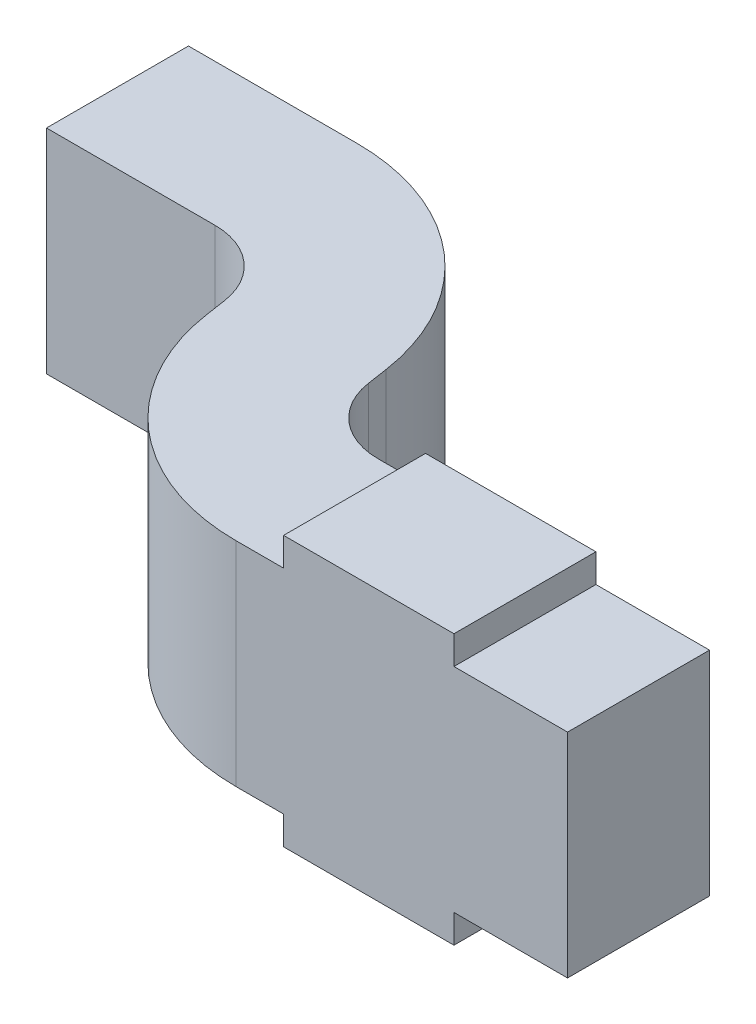
ISO-10303-21;
HEADER;
FILE_DESCRIPTION(('STEP AP214'),'2;1');
FILE_NAME('part.step','',(''),(''),'','','');
FILE_SCHEMA(('AUTOMOTIVE_DESIGN { 1 0 10303 214 1 1 1 1 }'));
ENDSEC;
DATA;
#1=APPLICATION_CONTEXT('core data for automotive mechanical design processes');
#2=APPLICATION_PROTOCOL_DEFINITION('international standard','automotive_design',2000,#1);
#3=PRODUCT_CONTEXT('',#1,'mechanical');
#4=PRODUCT('Part','Part','',(#3));
#5=PRODUCT_RELATED_PRODUCT_CATEGORY('part','',(#4));
#6=PRODUCT_DEFINITION_FORMATION('','',#4);
#7=PRODUCT_DEFINITION_CONTEXT('part definition',#1,'design');
#8=PRODUCT_DEFINITION('design','',#6,#7);
#9=PRODUCT_DEFINITION_SHAPE('','',#8);
#10=(LENGTH_UNIT() NAMED_UNIT(*) SI_UNIT(.MILLI.,.METRE.));
#11=(NAMED_UNIT(*) PLANE_ANGLE_UNIT() SI_UNIT($,.RADIAN.));
#12=(NAMED_UNIT(*) SI_UNIT($,.STERADIAN.) SOLID_ANGLE_UNIT());
#13=UNCERTAINTY_MEASURE_WITH_UNIT(LENGTH_MEASURE(1.E-05),#10,'distance_accuracy_value','');
#14=(GEOMETRIC_REPRESENTATION_CONTEXT(3) GLOBAL_UNCERTAINTY_ASSIGNED_CONTEXT((#13)) GLOBAL_UNIT_ASSIGNED_CONTEXT((#10,
#11,#12)) REPRESENTATION_CONTEXT('',''));
#15=CARTESIAN_POINT('',(0.,0.,0.));
#16=DIRECTION('',(0.,0.,1.));
#17=DIRECTION('',(1.,0.,0.));
#18=AXIS2_PLACEMENT_3D('',#15,#16,#17);
#19=CARTESIAN_POINT('',(-3.23,0.47500000000005,0.925));
#20=DIRECTION('',(0.,1.,0.));
#21=DIRECTION('',(1.,0.,0.));
#22=AXIS2_PLACEMENT_3D('',#19,#20,#21);
#23=PLANE('',#22);
#24=DIRECTION('',(1.,0.,0.));
#25=VECTOR('',#24,1.);
#26=CARTESIAN_POINT('',(-3.23,0.47500000000005,1.425));
#27=LINE('',#26,#25);
#28=CARTESIAN_POINT('',(-3.23,0.47500000000005,1.425));
#29=VERTEX_POINT('',#28);
#30=CARTESIAN_POINT('',(-2.63000000000008,0.47500000000005,1.425));
#31=VERTEX_POINT('',#30);
#32=EDGE_CURVE('E313',#29,#31,#27,.T.);
#33=ORIENTED_EDGE('',*,*,#32,.T.);
#34=DIRECTION('',(0.,0.,1.));
#35=VECTOR('',#34,1.);
#36=CARTESIAN_POINT('',(-2.63000000000008,0.47500000000005,0.925));
#37=LINE('',#36,#35);
#38=CARTESIAN_POINT('',(-2.63000000000008,0.47500000000005,0.925));
#39=VERTEX_POINT('',#38);
#40=EDGE_CURVE('E243',#39,#31,#37,.T.);
#41=ORIENTED_EDGE('',*,*,#40,.F.);
#42=DIRECTION('',(1.,0.,0.));
#43=VECTOR('',#42,1.);
#44=CARTESIAN_POINT('',(-3.23,0.47500000000005,0.925));
#45=LINE('',#44,#43);
#46=CARTESIAN_POINT('',(-3.23,0.47500000000005,0.925));
#47=VERTEX_POINT('',#46);
#48=EDGE_CURVE('E355',#47,#39,#45,.T.);
#49=ORIENTED_EDGE('',*,*,#48,.F.);
#50=DIRECTION('',(0.,0.,1.));
#51=VECTOR('',#50,1.);
#52=CARTESIAN_POINT('',(-3.23,0.47500000000005,0.925));
#53=LINE('',#52,#51);
#54=EDGE_CURVE('E419',#47,#29,#53,.T.);
#55=ORIENTED_EDGE('',*,*,#54,.T.);
#56=EDGE_LOOP('',(#33,#41,#49,#55));
#57=FACE_BOUND('',#56,.T.);
#58=ADVANCED_FACE('F17',(#57),#23,.T.);
#59=CARTESIAN_POINT('',(-3.23,-0.47499999999994,0.925));
#60=DIRECTION('',(-1.,0.,0.));
#61=DIRECTION('',(0.,0.,1.));
#62=AXIS2_PLACEMENT_3D('',#59,#60,#61);
#63=PLANE('',#62);
#64=DIRECTION('',(0.,0.,-1.));
#65=VECTOR('',#64,1.);
#66=CARTESIAN_POINT('',(-3.23,-0.375,0.85410254983609));
#67=LINE('',#66,#65);
#68=CARTESIAN_POINT('',(-3.23,-0.375,1.425));
#69=VERTEX_POINT('',#68);
#70=CARTESIAN_POINT('',(-3.23,-0.375,0.924999999999963));
#71=VERTEX_POINT('',#70);
#72=EDGE_CURVE('E253',#69,#71,#67,.T.);
#73=ORIENTED_EDGE('',*,*,#72,.T.);
#74=DIRECTION('',(0.,1.,0.));
#75=VECTOR('',#74,1.);
#76=CARTESIAN_POINT('',(-3.23,-0.47499999999994,0.925));
#77=LINE('',#76,#75);
#78=CARTESIAN_POINT('',(-3.23,-0.47499999999994,0.925));
#79=VERTEX_POINT('',#78);
#80=EDGE_CURVE('E399',#79,#71,#77,.T.);
#81=ORIENTED_EDGE('',*,*,#80,.F.);
#82=DIRECTION('',(0.,0.,1.));
#83=VECTOR('',#82,1.);
#84=CARTESIAN_POINT('',(-3.23,-0.47499999999994,0.925));
#85=LINE('',#84,#83);
#86=CARTESIAN_POINT('',(-3.23,-0.47499999999994,1.425));
#87=VERTEX_POINT('',#86);
#88=EDGE_CURVE('E11',#79,#87,#85,.T.);
#89=ORIENTED_EDGE('',*,*,#88,.T.);
#90=DIRECTION('',(0.,1.,0.));
#91=VECTOR('',#90,1.);
#92=CARTESIAN_POINT('',(-3.23,-0.47499999999994,1.425));
#93=LINE('',#92,#91);
#94=EDGE_CURVE('E310',#87,#69,#93,.T.);
#95=ORIENTED_EDGE('',*,*,#94,.T.);
#96=EDGE_LOOP('',(#73,#81,#89,#95));
#97=FACE_BOUND('',#96,.T.);
#98=ADVANCED_FACE('F471',(#97),#63,.T.);
#99=CARTESIAN_POINT('',(-2.63000000000008,-0.47499999999994,0.925));
#100=DIRECTION('',(0.,-1.,0.));
#101=DIRECTION('',(-1.,0.,0.));
#102=AXIS2_PLACEMENT_3D('',#99,#100,#101);
#103=PLANE('',#102);
#104=DIRECTION('',(-1.,0.,0.));
#105=VECTOR('',#104,1.);
#106=CARTESIAN_POINT('',(-2.63000000000008,-0.47499999999994,1.425));
#107=LINE('',#106,#105);
#108=CARTESIAN_POINT('',(-2.63000000000008,-0.47499999999994,1.425));
#109=VERTEX_POINT('',#108);
#110=EDGE_CURVE('E239',#109,#87,#107,.T.);
#111=ORIENTED_EDGE('',*,*,#110,.T.);
#112=ORIENTED_EDGE('',*,*,#88,.F.);
#113=DIRECTION('',(-1.,0.,0.));
#114=VECTOR('',#113,1.);
#115=CARTESIAN_POINT('',(-2.63000000000008,-0.47499999999994,0.925));
#116=LINE('',#115,#114);
#117=CARTESIAN_POINT('',(-2.63000000000008,-0.47499999999994,0.925));
#118=VERTEX_POINT('',#117);
#119=EDGE_CURVE('E294',#118,#79,#116,.T.);
#120=ORIENTED_EDGE('',*,*,#119,.F.);
#121=DIRECTION('',(0.,0.,1.));
#122=VECTOR('',#121,1.);
#123=CARTESIAN_POINT('',(-2.63000000000008,-0.47499999999994,0.925));
#124=LINE('',#123,#122);
#125=EDGE_CURVE('E25',#118,#109,#124,.T.);
#126=ORIENTED_EDGE('',*,*,#125,.T.);
#127=EDGE_LOOP('',(#111,#112,#120,#126));
#128=FACE_BOUND('',#127,.T.);
#129=ADVANCED_FACE('F472',(#128),#103,.T.);
#130=CARTESIAN_POINT('',(-2.63000000000008,0.47500000000005,0.925));
#131=DIRECTION('',(1.,0.,0.));
#132=DIRECTION('',(0.,-1.,0.));
#133=AXIS2_PLACEMENT_3D('',#130,#131,#132);
#134=PLANE('',#133);
#135=DIRECTION('',(0.,0.,1.));
#136=VECTOR('',#135,1.);
#137=CARTESIAN_POINT('',(-2.63000000000008,-0.375,0.85410254983609));
#138=LINE('',#137,#136);
#139=CARTESIAN_POINT('',(-2.63000000000008,-0.375,0.925));
#140=VERTEX_POINT('',#139);
#141=CARTESIAN_POINT('',(-2.63000000000008,-0.375,1.425));
#142=VERTEX_POINT('',#141);
#143=EDGE_CURVE('E249',#140,#142,#138,.T.);
#144=ORIENTED_EDGE('',*,*,#143,.T.);
#145=DIRECTION('',(0.,-1.,0.));
#146=VECTOR('',#145,1.);
#147=CARTESIAN_POINT('',(-2.63000000000008,0.47500000000005,1.425));
#148=LINE('',#147,#146);
#149=EDGE_CURVE('E232',#142,#109,#148,.T.);
#150=ORIENTED_EDGE('',*,*,#149,.T.);
#151=ORIENTED_EDGE('',*,*,#125,.F.);
#152=DIRECTION('',(0.,-1.,0.));
#153=VECTOR('',#152,1.);
#154=CARTESIAN_POINT('',(-2.63000000000008,0.47500000000005,0.925));
#155=LINE('',#154,#153);
#156=EDGE_CURVE('E257',#140,#118,#155,.T.);
#157=ORIENTED_EDGE('',*,*,#156,.F.);
#158=EDGE_LOOP('',(#144,#150,#151,#157));
#159=FACE_BOUND('',#158,.T.);
#160=ADVANCED_FACE('F255',(#159),#134,.T.);
#161=CARTESIAN_POINT('',(-2.63000000000008,0.47500000000005,0.925));
#162=DIRECTION('',(1.,0.,0.));
#163=DIRECTION('',(0.,-1.,0.));
#164=AXIS2_PLACEMENT_3D('',#161,#162,#163);
#165=PLANE('',#164);
#166=DIRECTION('',(0.,0.,-1.));
#167=VECTOR('',#166,1.);
#168=CARTESIAN_POINT('',(-2.63000000000008,0.375,0.85410254983609));
#169=LINE('',#168,#167);
#170=CARTESIAN_POINT('',(-2.63000000000008,0.375,1.425));
#171=VERTEX_POINT('',#170);
#172=CARTESIAN_POINT('',(-2.63000000000008,0.375,0.925));
#173=VERTEX_POINT('',#172);
#174=EDGE_CURVE('E339',#171,#173,#169,.T.);
#175=ORIENTED_EDGE('',*,*,#174,.T.);
#176=DIRECTION('',(0.,-1.,0.));
#177=VECTOR('',#176,1.);
#178=CARTESIAN_POINT('',(-2.63000000000008,0.47500000000005,0.925));
#179=LINE('',#178,#177);
#180=EDGE_CURVE('E351',#39,#173,#179,.T.);
#181=ORIENTED_EDGE('',*,*,#180,.F.);
#182=ORIENTED_EDGE('',*,*,#40,.T.);
#183=DIRECTION('',(0.,-1.,0.));
#184=VECTOR('',#183,1.);
#185=CARTESIAN_POINT('',(-2.63000000000008,0.47500000000005,1.425));
#186=LINE('',#185,#184);
#187=EDGE_CURVE('E354',#31,#171,#186,.T.);
#188=ORIENTED_EDGE('',*,*,#187,.T.);
#189=EDGE_LOOP('',(#175,#181,#182,#188));
#190=FACE_BOUND('',#189,.T.);
#191=ADVANCED_FACE('F438',(#190),#165,.T.);
#192=CARTESIAN_POINT('',(-2.93000000000004,0.,1.425));
#193=DIRECTION('',(0.,0.,1.));
#194=DIRECTION('',(1.,0.,0.));
#195=AXIS2_PLACEMENT_3D('',#192,#193,#194);
#196=PLANE('',#195);
#197=ORIENTED_EDGE('',*,*,#187,.F.);
#198=ORIENTED_EDGE('',*,*,#32,.F.);
#199=DIRECTION('',(0.,1.,0.));
#200=VECTOR('',#199,1.);
#201=CARTESIAN_POINT('',(-3.23,-0.47499999999994,1.425));
#202=LINE('',#201,#200);
#203=CARTESIAN_POINT('',(-3.23,0.375,1.425));
#204=VERTEX_POINT('',#203);
#205=EDGE_CURVE('E415',#204,#29,#202,.T.);
#206=ORIENTED_EDGE('',*,*,#205,.F.);
#207=DIRECTION('',(-1.,0.,0.));
#208=VECTOR('',#207,1.);
#209=CARTESIAN_POINT('',(-2.23000000000008,0.375,1.425));
#210=LINE('',#209,#208);
#211=CARTESIAN_POINT('',(-3.39710678118641,0.375,1.425));
#212=VERTEX_POINT('',#211);
#213=EDGE_CURVE('E412',#204,#212,#210,.T.);
#214=ORIENTED_EDGE('',*,*,#213,.T.);
#215=DIRECTION('',(0.,1.,0.));
#216=VECTOR('',#215,1.);
#217=CARTESIAN_POINT('',(-3.39710678118641,-0.375,1.425));
#218=LINE('',#217,#216);
#219=CARTESIAN_POINT('',(-3.39710678118641,-0.375,1.425));
#220=VERTEX_POINT('',#219);
#221=EDGE_CURVE('E356',#220,#212,#218,.T.);
#222=ORIENTED_EDGE('',*,*,#221,.F.);
#223=DIRECTION('',(-1.,0.,0.));
#224=VECTOR('',#223,1.);
#225=CARTESIAN_POINT('',(-2.23000000000008,-0.375,1.425));
#226=LINE('',#225,#224);
#227=EDGE_CURVE('E279',#69,#220,#226,.T.);
#228=ORIENTED_EDGE('',*,*,#227,.F.);
#229=ORIENTED_EDGE('',*,*,#94,.F.);
#230=ORIENTED_EDGE('',*,*,#110,.F.);
#231=ORIENTED_EDGE('',*,*,#149,.F.);
#232=DIRECTION('',(-1.,0.,0.));
#233=VECTOR('',#232,1.);
#234=CARTESIAN_POINT('',(-2.23000000000008,-0.375,1.425));
#235=LINE('',#234,#233);
#236=CARTESIAN_POINT('',(-2.23000000000008,-0.375,1.425));
#237=VERTEX_POINT('',#236);
#238=EDGE_CURVE('E236',#237,#142,#235,.T.);
#239=ORIENTED_EDGE('',*,*,#238,.F.);
#240=DIRECTION('',(0.,1.,0.));
#241=VECTOR('',#240,1.);
#242=CARTESIAN_POINT('',(-2.23000000000008,-0.375,1.425));
#243=LINE('',#242,#241);
#244=CARTESIAN_POINT('',(-2.23000000000008,0.375,1.425));
#245=VERTEX_POINT('',#244);
#246=EDGE_CURVE('E287',#237,#245,#243,.T.);
#247=ORIENTED_EDGE('',*,*,#246,.T.);
#248=DIRECTION('',(-1.,0.,0.));
#249=VECTOR('',#248,1.);
#250=CARTESIAN_POINT('',(-2.23000000000008,0.375,1.425));
#251=LINE('',#250,#249);
#252=EDGE_CURVE('E343',#245,#171,#251,.T.);
#253=ORIENTED_EDGE('',*,*,#252,.T.);
#254=EDGE_LOOP('',(#197,#198,#206,#214,#222,#228,#229,#230,#231,#239,#247,#253));
#255=FACE_BOUND('',#254,.T.);
#256=ADVANCED_FACE('F235',(#255),#196,.T.);
#257=CARTESIAN_POINT('',(-2.93000000000004,0.,0.925));
#258=DIRECTION('',(0.,0.,1.));
#259=DIRECTION('',(1.,0.,0.));
#260=AXIS2_PLACEMENT_3D('',#257,#258,#259);
#261=PLANE('',#260);
#262=ORIENTED_EDGE('',*,*,#156,.T.);
#263=ORIENTED_EDGE('',*,*,#119,.T.);
#264=ORIENTED_EDGE('',*,*,#80,.T.);
#265=DIRECTION('',(1.,0.,0.));
#266=VECTOR('',#265,1.);
#267=CARTESIAN_POINT('',(-3.39710678118641,-0.375,0.924999999999955));
#268=LINE('',#267,#266);
#269=CARTESIAN_POINT('',(-3.39710678118641,-0.375,0.924999999999955));
#270=VERTEX_POINT('',#269);
#271=EDGE_CURVE('E335',#270,#71,#268,.T.);
#272=ORIENTED_EDGE('',*,*,#271,.F.);
#273=DIRECTION('',(0.,1.,0.));
#274=VECTOR('',#273,1.);
#275=CARTESIAN_POINT('',(-3.39710678118641,-0.375,0.924999999999955));
#276=LINE('',#275,#274);
#277=CARTESIAN_POINT('',(-3.39710678118641,0.375,0.924999999999955));
#278=VERTEX_POINT('',#277);
#279=EDGE_CURVE('E508',#270,#278,#276,.T.);
#280=ORIENTED_EDGE('',*,*,#279,.T.);
#281=DIRECTION('',(1.,0.,0.));
#282=VECTOR('',#281,1.);
#283=CARTESIAN_POINT('',(-3.39710678118641,0.375,0.924999999999955));
#284=LINE('',#283,#282);
#285=CARTESIAN_POINT('',(-3.23,0.375,0.924999999999963));
#286=VERTEX_POINT('',#285);
#287=EDGE_CURVE('E394',#278,#286,#284,.T.);
#288=ORIENTED_EDGE('',*,*,#287,.T.);
#289=DIRECTION('',(0.,1.,0.));
#290=VECTOR('',#289,1.);
#291=CARTESIAN_POINT('',(-3.23,-0.47499999999994,0.925));
#292=LINE('',#291,#290);
#293=EDGE_CURVE('E295',#286,#47,#292,.T.);
#294=ORIENTED_EDGE('',*,*,#293,.T.);
#295=ORIENTED_EDGE('',*,*,#48,.T.);
#296=ORIENTED_EDGE('',*,*,#180,.T.);
#297=DIRECTION('',(1.,0.,0.));
#298=VECTOR('',#297,1.);
#299=CARTESIAN_POINT('',(-3.39710678118641,0.375,0.924999999999955));
#300=LINE('',#299,#298);
#301=CARTESIAN_POINT('',(-2.23000000000008,0.375,0.925000000000011));
#302=VERTEX_POINT('',#301);
#303=EDGE_CURVE('E327',#173,#302,#300,.T.);
#304=ORIENTED_EDGE('',*,*,#303,.T.);
#305=DIRECTION('',(0.,1.,0.));
#306=VECTOR('',#305,1.);
#307=CARTESIAN_POINT('',(-2.23000000000008,-0.375,0.925000000000011));
#308=LINE('',#307,#306);
#309=CARTESIAN_POINT('',(-2.23000000000008,-0.375,0.925000000000011));
#310=VERTEX_POINT('',#309);
#311=EDGE_CURVE('E361',#310,#302,#308,.T.);
#312=ORIENTED_EDGE('',*,*,#311,.F.);
#313=DIRECTION('',(1.,0.,0.));
#314=VECTOR('',#313,1.);
#315=CARTESIAN_POINT('',(-3.39710678118641,-0.375,0.924999999999955));
#316=LINE('',#315,#314);
#317=EDGE_CURVE('E260',#140,#310,#316,.T.);
#318=ORIENTED_EDGE('',*,*,#317,.F.);
#319=EDGE_LOOP('',(#262,#263,#264,#272,#280,#288,#294,#295,#296,#304,#312,#318));
#320=FACE_BOUND('',#319,.T.);
#321=ADVANCED_FACE('F449',(#320),#261,.F.);
#322=CARTESIAN_POINT('',(-3.23,-0.47499999999994,0.925));
#323=DIRECTION('',(-1.,0.,0.));
#324=DIRECTION('',(0.,0.,1.));
#325=AXIS2_PLACEMENT_3D('',#322,#323,#324);
#326=PLANE('',#325);
#327=DIRECTION('',(0.,0.,1.));
#328=VECTOR('',#327,1.);
#329=CARTESIAN_POINT('',(-3.23,0.375,0.85410254983609));
#330=LINE('',#329,#328);
#331=EDGE_CURVE('E390',#286,#204,#330,.T.);
#332=ORIENTED_EDGE('',*,*,#331,.T.);
#333=ORIENTED_EDGE('',*,*,#205,.T.);
#334=ORIENTED_EDGE('',*,*,#54,.F.);
#335=ORIENTED_EDGE('',*,*,#293,.F.);
#336=EDGE_LOOP('',(#332,#333,#334,#335));
#337=FACE_BOUND('',#336,.T.);
#338=ADVANCED_FACE('F453',(#337),#326,.T.);
#339=CARTESIAN_POINT('',(-3.64791907855811,0.375,0.78320509967218));
#340=DIRECTION('',(0.,-1.,0.));
#341=DIRECTION('',(-1.,0.,0.));
#342=AXIS2_PLACEMENT_3D('',#339,#340,#341);
#343=PLANE('',#342);
#344=ORIENTED_EDGE('',*,*,#331,.F.);
#345=ORIENTED_EDGE('',*,*,#287,.F.);
#346=CARTESIAN_POINT('',(-3.39710678118638,0.375,0.67499999999993));
#347=DIRECTION('',(0.,1.,0.));
#348=DIRECTION('',(-0.65224191465017,0.,0.758010873783141));
#349=AXIS2_PLACEMENT_3D('',#346,#347,#348);
#350=CIRCLE('',#349,0.250000000000025);
#351=CARTESIAN_POINT('',(-3.56016725984894,0.375,0.864502718445734));
#352=VERTEX_POINT('',#351);
#353=EDGE_CURVE('E519',#352,#278,#350,.T.);
#354=ORIENTED_EDGE('',*,*,#353,.F.);
#355=CARTESIAN_POINT('',(-3.39710678118638,0.375,0.67499999999993));
#356=DIRECTION('',(0.,1.,0.));
#357=DIRECTION('',(-0.65224191465017,0.,0.758010873783141));
#358=AXIS2_PLACEMENT_3D('',#355,#356,#357);
#359=CIRCLE('',#358,0.250000000000025);
#360=CARTESIAN_POINT('',(-3.64431001300739,0.375,0.7122902423867));
#361=VERTEX_POINT('',#360);
#362=EDGE_CURVE('E284',#361,#352,#359,.T.);
#363=ORIENTED_EDGE('',*,*,#362,.F.);
#364=DIRECTION('',(0.149160969547199,0.,0.988812927283892));
#365=VECTOR('',#364,1.);
#366=CARTESIAN_POINT('',(-3.65549708572354,0.375,0.638129272839649));
#367=LINE('',#366,#365);
#368=CARTESIAN_POINT('',(-3.65549708572354,0.375,0.638129272839649));
#369=VERTEX_POINT('',#368);
#370=EDGE_CURVE('E384',#369,#361,#367,.T.);
#371=ORIENTED_EDGE('',*,*,#370,.F.);
#372=CARTESIAN_POINT('',(-4.39710678118645,0.375,0.750000000000045));
#373=DIRECTION('',(0.,-1.,0.));
#374=DIRECTION('',(0.652241914650113,0.,-0.75801087378319));
#375=AXIS2_PLACEMENT_3D('',#372,#373,#374);
#376=CIRCLE('',#375,0.749999999999988);
#377=CARTESIAN_POINT('',(-3.90792534519888,0.375,0.181491844662661));
#378=VERTEX_POINT('',#377);
#379=EDGE_CURVE('E479',#378,#369,#376,.T.);
#380=ORIENTED_EDGE('',*,*,#379,.F.);
#381=CARTESIAN_POINT('',(-4.39710678118645,0.375,0.750000000000045));
#382=DIRECTION('',(0.,-1.,0.));
#383=DIRECTION('',(0.652241914650113,0.,-0.75801087378319));
#384=AXIS2_PLACEMENT_3D('',#381,#382,#383);
#385=CIRCLE('',#384,0.749999999999988);
#386=CARTESIAN_POINT('',(-4.39710678118638,0.375,0.));
#387=VERTEX_POINT('',#386);
#388=EDGE_CURVE('E381',#387,#378,#385,.T.);
#389=ORIENTED_EDGE('',*,*,#388,.F.);
#390=DIRECTION('',(1.,0.,0.));
#391=VECTOR('',#390,1.);
#392=CARTESIAN_POINT('',(-4.99,0.375,0.));
#393=LINE('',#392,#391);
#394=CARTESIAN_POINT('',(-4.99,0.375,0.));
#395=VERTEX_POINT('',#394);
#396=EDGE_CURVE('E304',#395,#387,#393,.T.);
#397=ORIENTED_EDGE('',*,*,#396,.F.);
#398=DIRECTION('',(0.,0.,-1.));
#399=VECTOR('',#398,1.);
#400=CARTESIAN_POINT('',(-4.99,0.375,0.499999999999943));
#401=LINE('',#400,#399);
#402=CARTESIAN_POINT('',(-4.99,0.375,0.499999999999943));
#403=VERTEX_POINT('',#402);
#404=EDGE_CURVE('E305',#403,#395,#401,.T.);
#405=ORIENTED_EDGE('',*,*,#404,.F.);
#406=DIRECTION('',(-1.,0.,-6.71122420360616E-13));
#407=VECTOR('',#406,1.);
#408=CARTESIAN_POINT('',(-4.39710678118624,0.375,0.500000000000341));
#409=LINE('',#408,#407);
#410=CARTESIAN_POINT('',(-4.39710678118624,0.375,0.500000000000341));
#411=VERTEX_POINT('',#410);
#412=EDGE_CURVE('E364',#411,#403,#409,.T.);
#413=ORIENTED_EDGE('',*,*,#412,.F.);
#414=CARTESIAN_POINT('',(-4.39710678118642,0.375,0.750000000000349));
#415=DIRECTION('',(0.,1.,0.));
#416=DIRECTION('',(0.652241914650429,0.,-0.758010873782918));
#417=AXIS2_PLACEMENT_3D('',#414,#415,#416);
#418=CIRCLE('',#417,0.250000000000008);
#419=CARTESIAN_POINT('',(-4.2340463025238,0.375,0.560497281554614));
#420=VERTEX_POINT('',#419);
#421=EDGE_CURVE('E270',#420,#411,#418,.T.);
#422=ORIENTED_EDGE('',*,*,#421,.F.);
#423=CARTESIAN_POINT('',(-4.39710678118642,0.375,0.750000000000349));
#424=DIRECTION('',(0.,1.,0.));
#425=DIRECTION('',(0.652241914650429,0.,-0.758010873782918));
#426=AXIS2_PLACEMENT_3D('',#423,#424,#425);
#427=CIRCLE('',#426,0.250000000000008);
#428=CARTESIAN_POINT('',(-4.14990354936543,0.375,0.712709757613595));
#429=VERTEX_POINT('',#428);
#430=EDGE_CURVE('E350',#429,#420,#427,.T.);
#431=ORIENTED_EDGE('',*,*,#430,.F.);
#432=DIRECTION('',(-0.149160969547128,0.,-0.988812927283903));
#433=VECTOR('',#432,1.);
#434=CARTESIAN_POINT('',(-4.13871647664934,0.375,0.786870727160306));
#435=LINE('',#434,#433);
#436=CARTESIAN_POINT('',(-4.13871647664934,0.375,0.786870727160306));
#437=VERTEX_POINT('',#436);
#438=EDGE_CURVE('E395',#437,#429,#435,.T.);
#439=ORIENTED_EDGE('',*,*,#438,.F.);
#440=CARTESIAN_POINT('',(-3.3971067811864,0.375,0.67500000000001));
#441=DIRECTION('',(0.,-1.,0.));
#442=DIRECTION('',(-0.652241914650137,0.,0.758010873783169));
#443=AXIS2_PLACEMENT_3D('',#440,#441,#442);
#444=CIRCLE('',#443,0.75);
#445=CARTESIAN_POINT('',(-3.886288217174,0.375,1.24350815533739));
#446=VERTEX_POINT('',#445);
#447=EDGE_CURVE('E460',#446,#437,#444,.T.);
#448=ORIENTED_EDGE('',*,*,#447,.F.);
#449=CARTESIAN_POINT('',(-3.3971067811864,0.375,0.67500000000001));
#450=DIRECTION('',(0.,-1.,0.));
#451=DIRECTION('',(-0.652241914650137,0.,0.758010873783169));
#452=AXIS2_PLACEMENT_3D('',#449,#450,#451);
#453=CIRCLE('',#452,0.75);
#454=EDGE_CURVE('E360',#212,#446,#453,.T.);
#455=ORIENTED_EDGE('',*,*,#454,.F.);
#456=ORIENTED_EDGE('',*,*,#213,.F.);
#457=EDGE_LOOP('',(#344,#345,#354,#363,#371,#380,#389,#397,#405,#413,#422,#431,#439,#448,#455,#456));
#458=FACE_BOUND('',#457,.T.);
#459=ADVANCED_FACE('F457',(#458),#343,.F.);
#460=CARTESIAN_POINT('',(-4.13871647664934,-0.375,0.786870727160306));
#461=DIRECTION('',(-0.988812927283903,0.,0.149160969547128));
#462=DIRECTION('',(0.,1.,0.));
#463=AXIS2_PLACEMENT_3D('',#460,#461,#462);
#464=PLANE('',#463);
#465=ORIENTED_EDGE('',*,*,#438,.T.);
#466=DIRECTION('',(0.,1.,0.));
#467=VECTOR('',#466,1.);
#468=CARTESIAN_POINT('',(-4.14990354936544,-0.375,0.712709757613595));
#469=LINE('',#468,#467);
#470=CARTESIAN_POINT('',(-4.14990354936544,-0.375,0.712709757613595));
#471=VERTEX_POINT('',#470);
#472=EDGE_CURVE('E331',#471,#429,#469,.T.);
#473=ORIENTED_EDGE('',*,*,#472,.F.);
#474=DIRECTION('',(-0.149160969547128,0.,-0.988812927283903));
#475=VECTOR('',#474,1.);
#476=CARTESIAN_POINT('',(-4.13871647664934,-0.375,0.786870727160306));
#477=LINE('',#476,#475);
#478=CARTESIAN_POINT('',(-4.13871647664934,-0.375,0.786870727160306));
#479=VERTEX_POINT('',#478);
#480=EDGE_CURVE('E291',#479,#471,#477,.T.);
#481=ORIENTED_EDGE('',*,*,#480,.F.);
#482=DIRECTION('',(0.,1.,0.));
#483=VECTOR('',#482,1.);
#484=CARTESIAN_POINT('',(-4.13871647664934,-0.375,0.786870727160306));
#485=LINE('',#484,#483);
#486=EDGE_CURVE('E524',#479,#437,#485,.T.);
#487=ORIENTED_EDGE('',*,*,#486,.T.);
#488=EDGE_LOOP('',(#465,#473,#481,#487));
#489=FACE_BOUND('',#488,.T.);
#490=ADVANCED_FACE('F975',(#489),#464,.T.);
#491=CARTESIAN_POINT('',(-3.3971067811864,-0.375,0.67500000000001));
#492=DIRECTION('',(0.,1.,0.));
#493=DIRECTION('',(-0.652241914650137,0.,0.758010873783169));
#494=AXIS2_PLACEMENT_3D('',#491,#492,#493);
#495=CYLINDRICAL_SURFACE('',#494,0.75);
#496=DIRECTION('',(0.,1.,0.));
#497=VECTOR('',#496,1.);
#498=CARTESIAN_POINT('',(-3.886288217174,-0.375,1.24350815533739));
#499=LINE('',#498,#497);
#500=CARTESIAN_POINT('',(-3.886288217174,-0.375,1.24350815533739));
#501=VERTEX_POINT('',#500);
#502=EDGE_CURVE('E533',#501,#446,#499,.T.);
#503=ORIENTED_EDGE('',*,*,#502,.F.);
#504=CARTESIAN_POINT('',(-3.3971067811864,-0.375,0.67500000000001));
#505=DIRECTION('',(0.,-1.,0.));
#506=DIRECTION('',(-0.652241914650137,0.,0.758010873783169));
#507=AXIS2_PLACEMENT_3D('',#504,#505,#506);
#508=CIRCLE('',#507,0.75);
#509=EDGE_CURVE('E283',#220,#501,#508,.T.);
#510=ORIENTED_EDGE('',*,*,#509,.F.);
#511=ORIENTED_EDGE('',*,*,#221,.T.);
#512=ORIENTED_EDGE('',*,*,#454,.T.);
#513=EDGE_LOOP('',(#503,#510,#511,#512));
#514=FACE_BOUND('',#513,.T.);
#515=ADVANCED_FACE('F465',(#514),#495,.T.);
#516=CARTESIAN_POINT('',(-2.23000000000008,-0.375,0.925000000000011));
#517=DIRECTION('',(1.,0.,0.));
#518=DIRECTION('',(0.,-1.,0.));
#519=AXIS2_PLACEMENT_3D('',#516,#517,#518);
#520=PLANE('',#519);
#521=DIRECTION('',(0.,0.,1.));
#522=VECTOR('',#521,1.);
#523=CARTESIAN_POINT('',(-2.23000000000008,0.375,0.925000000000011));
#524=LINE('',#523,#522);
#525=EDGE_CURVE('E332',#302,#245,#524,.T.);
#526=ORIENTED_EDGE('',*,*,#525,.T.);
#527=ORIENTED_EDGE('',*,*,#246,.F.);
#528=DIRECTION('',(0.,0.,1.));
#529=VECTOR('',#528,1.);
#530=CARTESIAN_POINT('',(-2.23000000000008,-0.375,0.925000000000011));
#531=LINE('',#530,#529);
#532=EDGE_CURVE('E251',#310,#237,#531,.T.);
#533=ORIENTED_EDGE('',*,*,#532,.F.);
#534=ORIENTED_EDGE('',*,*,#311,.T.);
#535=EDGE_LOOP('',(#526,#527,#533,#534));
#536=FACE_BOUND('',#535,.T.);
#537=ADVANCED_FACE('F916',(#536),#520,.T.);
#538=CARTESIAN_POINT('',(-3.39710678118638,-0.375,0.67499999999993));
#539=DIRECTION('',(0.,1.,0.));
#540=DIRECTION('',(-0.65224191465017,0.,0.758010873783141));
#541=AXIS2_PLACEMENT_3D('',#538,#539,#540);
#542=CYLINDRICAL_SURFACE('',#541,0.250000000000025);
#543=DIRECTION('',(0.,1.,0.));
#544=VECTOR('',#543,1.);
#545=CARTESIAN_POINT('',(-3.56016725984894,-0.375,0.864502718445734));
#546=LINE('',#545,#544);
#547=CARTESIAN_POINT('',(-3.56016725984894,-0.375,0.864502718445734));
#548=VERTEX_POINT('',#547);
#549=EDGE_CURVE('E523',#548,#352,#546,.T.);
#550=ORIENTED_EDGE('',*,*,#549,.F.);
#551=CARTESIAN_POINT('',(-3.39710678118638,-0.375,0.67499999999993));
#552=DIRECTION('',(0.,1.,0.));
#553=DIRECTION('',(-0.65224191465017,0.,0.758010873783141));
#554=AXIS2_PLACEMENT_3D('',#551,#552,#553);
#555=CIRCLE('',#554,0.250000000000025);
#556=CARTESIAN_POINT('',(-3.64431001300739,-0.375,0.7122902423867));
#557=VERTEX_POINT('',#556);
#558=EDGE_CURVE('E326',#557,#548,#555,.T.);
#559=ORIENTED_EDGE('',*,*,#558,.F.);
#560=DIRECTION('',(0.,1.,0.));
#561=VECTOR('',#560,1.);
#562=CARTESIAN_POINT('',(-3.64431001300739,-0.375,0.7122902423867));
#563=LINE('',#562,#561);
#564=EDGE_CURVE('E288',#557,#361,#563,.T.);
#565=ORIENTED_EDGE('',*,*,#564,.T.);
#566=ORIENTED_EDGE('',*,*,#362,.T.);
#567=EDGE_LOOP('',(#550,#559,#565,#566));
#568=FACE_BOUND('',#567,.T.);
#569=ADVANCED_FACE('F559',(#568),#542,.F.);
#570=CARTESIAN_POINT('',(-3.65549708572354,-0.375,0.638129272839649));
#571=DIRECTION('',(0.988812927283892,0.,-0.149160969547199));
#572=DIRECTION('',(0.,-1.,0.));
#573=AXIS2_PLACEMENT_3D('',#570,#571,#572);
#574=PLANE('',#573);
#575=ORIENTED_EDGE('',*,*,#370,.T.);
#576=ORIENTED_EDGE('',*,*,#564,.F.);
#577=DIRECTION('',(0.149160969547199,0.,0.988812927283892));
#578=VECTOR('',#577,1.);
#579=CARTESIAN_POINT('',(-3.65549708572354,-0.375,0.638129272839649));
#580=LINE('',#579,#578);
#581=CARTESIAN_POINT('',(-3.65549708572354,-0.375,0.638129272839649));
#582=VERTEX_POINT('',#581);
#583=EDGE_CURVE('E322',#582,#557,#580,.T.);
#584=ORIENTED_EDGE('',*,*,#583,.F.);
#585=DIRECTION('',(0.,1.,0.));
#586=VECTOR('',#585,1.);
#587=CARTESIAN_POINT('',(-3.65549708572354,-0.375,0.638129272839649));
#588=LINE('',#587,#586);
#589=EDGE_CURVE('E481',#582,#369,#588,.T.);
#590=ORIENTED_EDGE('',*,*,#589,.T.);
#591=EDGE_LOOP('',(#575,#576,#584,#590));
#592=FACE_BOUND('',#591,.T.);
#593=ADVANCED_FACE('F563',(#592),#574,.T.);
#594=CARTESIAN_POINT('',(-4.39710678118645,-0.375,0.750000000000045));
#595=DIRECTION('',(0.,1.,0.));
#596=DIRECTION('',(0.652241914650113,0.,-0.75801087378319));
#597=AXIS2_PLACEMENT_3D('',#594,#595,#596);
#598=CYLINDRICAL_SURFACE('',#597,0.749999999999988);
#599=DIRECTION('',(0.,1.,0.));
#600=VECTOR('',#599,1.);
#601=CARTESIAN_POINT('',(-3.90792534519888,-0.375,0.181491844662661));
#602=LINE('',#601,#600);
#603=CARTESIAN_POINT('',(-3.90792534519888,-0.375,0.181491844662661));
#604=VERTEX_POINT('',#603);
#605=EDGE_CURVE('E507',#604,#378,#602,.T.);
#606=ORIENTED_EDGE('',*,*,#605,.F.);
#607=CARTESIAN_POINT('',(-4.39710678118645,-0.375,0.750000000000045));
#608=DIRECTION('',(0.,-1.,0.));
#609=DIRECTION('',(0.652241914650113,0.,-0.75801087378319));
#610=AXIS2_PLACEMENT_3D('',#607,#608,#609);
#611=CIRCLE('',#610,0.749999999999988);
#612=CARTESIAN_POINT('',(-4.39710678118638,-0.375,0.));
#613=VERTEX_POINT('',#612);
#614=EDGE_CURVE('E321',#613,#604,#611,.T.);
#615=ORIENTED_EDGE('',*,*,#614,.F.);
#616=DIRECTION('',(0.,1.,0.));
#617=VECTOR('',#616,1.);
#618=CARTESIAN_POINT('',(-4.39710678118638,-0.375,0.));
#619=LINE('',#618,#617);
#620=EDGE_CURVE('E377',#613,#387,#619,.T.);
#621=ORIENTED_EDGE('',*,*,#620,.T.);
#622=ORIENTED_EDGE('',*,*,#388,.T.);
#623=EDGE_LOOP('',(#606,#615,#621,#622));
#624=FACE_BOUND('',#623,.T.);
#625=ADVANCED_FACE('F886',(#624),#598,.T.);
#626=CARTESIAN_POINT('',(-4.99,-0.375,0.));
#627=DIRECTION('',(0.,0.,-1.));
#628=DIRECTION('',(0.,-1.,0.));
#629=AXIS2_PLACEMENT_3D('',#626,#627,#628);
#630=PLANE('',#629);
#631=ORIENTED_EDGE('',*,*,#396,.T.);
#632=ORIENTED_EDGE('',*,*,#620,.F.);
#633=DIRECTION('',(1.,0.,0.));
#634=VECTOR('',#633,1.);
#635=CARTESIAN_POINT('',(-4.99,-0.375,0.));
#636=LINE('',#635,#634);
#637=CARTESIAN_POINT('',(-4.99,-0.375,0.));
#638=VERTEX_POINT('',#637);
#639=EDGE_CURVE('E317',#638,#613,#636,.T.);
#640=ORIENTED_EDGE('',*,*,#639,.F.);
#641=DIRECTION('',(0.,1.,0.));
#642=VECTOR('',#641,1.);
#643=CARTESIAN_POINT('',(-4.99,-0.375,0.));
#644=LINE('',#643,#642);
#645=EDGE_CURVE('E300',#638,#395,#644,.T.);
#646=ORIENTED_EDGE('',*,*,#645,.T.);
#647=EDGE_LOOP('',(#631,#632,#640,#646));
#648=FACE_BOUND('',#647,.T.);
#649=ADVANCED_FACE('F898',(#648),#630,.T.);
#650=CARTESIAN_POINT('',(-4.99,-0.375,0.499999999999943));
#651=DIRECTION('',(-1.,0.,0.));
#652=DIRECTION('',(0.,0.,1.));
#653=AXIS2_PLACEMENT_3D('',#650,#651,#652);
#654=PLANE('',#653);
#655=ORIENTED_EDGE('',*,*,#404,.T.);
#656=ORIENTED_EDGE('',*,*,#645,.F.);
#657=DIRECTION('',(0.,0.,-1.));
#658=VECTOR('',#657,1.);
#659=CARTESIAN_POINT('',(-4.99,-0.375,0.499999999999943));
#660=LINE('',#659,#658);
#661=CARTESIAN_POINT('',(-4.99,-0.375,0.499999999999943));
#662=VERTEX_POINT('',#661);
#663=EDGE_CURVE('E309',#662,#638,#660,.T.);
#664=ORIENTED_EDGE('',*,*,#663,.F.);
#665=DIRECTION('',(0.,1.,0.));
#666=VECTOR('',#665,1.);
#667=CARTESIAN_POINT('',(-4.99,-0.375,0.499999999999943));
#668=LINE('',#667,#666);
#669=EDGE_CURVE('E368',#662,#403,#668,.T.);
#670=ORIENTED_EDGE('',*,*,#669,.T.);
#671=EDGE_LOOP('',(#655,#656,#664,#670));
#672=FACE_BOUND('',#671,.T.);
#673=ADVANCED_FACE('F902',(#672),#654,.T.);
#674=CARTESIAN_POINT('',(-4.39710678118624,-0.375,0.500000000000341));
#675=DIRECTION('',(-6.71122420360616E-13,0.,1.));
#676=DIRECTION('',(1.,0.,6.71122420360616E-13));
#677=AXIS2_PLACEMENT_3D('',#674,#675,#676);
#678=PLANE('',#677);
#679=ORIENTED_EDGE('',*,*,#412,.T.);
#680=ORIENTED_EDGE('',*,*,#669,.F.);
#681=DIRECTION('',(-1.,0.,-6.71122420360616E-13));
#682=VECTOR('',#681,1.);
#683=CARTESIAN_POINT('',(-4.39710678118624,-0.375,0.500000000000341));
#684=LINE('',#683,#682);
#685=CARTESIAN_POINT('',(-4.39710678118624,-0.375,0.500000000000341));
#686=VERTEX_POINT('',#685);
#687=EDGE_CURVE('E299',#686,#662,#684,.T.);
#688=ORIENTED_EDGE('',*,*,#687,.F.);
#689=DIRECTION('',(0.,1.,0.));
#690=VECTOR('',#689,1.);
#691=CARTESIAN_POINT('',(-4.39710678118624,-0.375,0.500000000000341));
#692=LINE('',#691,#690);
#693=EDGE_CURVE('E261',#686,#411,#692,.T.);
#694=ORIENTED_EDGE('',*,*,#693,.T.);
#695=EDGE_LOOP('',(#679,#680,#688,#694));
#696=FACE_BOUND('',#695,.T.);
#697=ADVANCED_FACE('F928',(#696),#678,.T.);
#698=CARTESIAN_POINT('',(-4.39710678118642,-0.375,0.750000000000349));
#699=DIRECTION('',(0.,1.,0.));
#700=DIRECTION('',(0.652241914650429,0.,-0.758010873782918));
#701=AXIS2_PLACEMENT_3D('',#698,#699,#700);
#702=CYLINDRICAL_SURFACE('',#701,0.250000000000008);
#703=DIRECTION('',(0.,1.,0.));
#704=VECTOR('',#703,1.);
#705=CARTESIAN_POINT('',(-4.2340463025238,-0.375,0.560497281554614));
#706=LINE('',#705,#704);
#707=CARTESIAN_POINT('',(-4.2340463025238,-0.375,0.560497281554614));
#708=VERTEX_POINT('',#707);
#709=EDGE_CURVE('E488',#708,#420,#706,.T.);
#710=ORIENTED_EDGE('',*,*,#709,.F.);
#711=CARTESIAN_POINT('',(-4.39710678118642,-0.375,0.750000000000349));
#712=DIRECTION('',(0.,1.,0.));
#713=DIRECTION('',(0.652241914650429,0.,-0.758010873782918));
#714=AXIS2_PLACEMENT_3D('',#711,#712,#713);
#715=CIRCLE('',#714,0.250000000000008);
#716=EDGE_CURVE('E296',#471,#708,#715,.T.);
#717=ORIENTED_EDGE('',*,*,#716,.F.);
#718=ORIENTED_EDGE('',*,*,#472,.T.);
#719=ORIENTED_EDGE('',*,*,#430,.T.);
#720=EDGE_LOOP('',(#710,#717,#718,#719));
#721=FACE_BOUND('',#720,.T.);
#722=ADVANCED_FACE('F911',(#721),#702,.F.);
#723=CARTESIAN_POINT('',(-3.64791907855811,0.375,0.78320509967218));
#724=DIRECTION('',(0.,-1.,0.));
#725=DIRECTION('',(-1.,0.,0.));
#726=AXIS2_PLACEMENT_3D('',#723,#724,#725);
#727=PLANE('',#726);
#728=ORIENTED_EDGE('',*,*,#174,.F.);
#729=ORIENTED_EDGE('',*,*,#252,.F.);
#730=ORIENTED_EDGE('',*,*,#525,.F.);
#731=ORIENTED_EDGE('',*,*,#303,.F.);
#732=EDGE_LOOP('',(#728,#729,#730,#731));
#733=FACE_BOUND('',#732,.T.);
#734=ADVANCED_FACE('F447',(#733),#727,.F.);
#735=CARTESIAN_POINT('',(-3.64791907855811,-0.375,0.78320509967218));
#736=DIRECTION('',(0.,-1.,0.));
#737=DIRECTION('',(-1.,0.,0.));
#738=AXIS2_PLACEMENT_3D('',#735,#736,#737);
#739=PLANE('',#738);
#740=ORIENTED_EDGE('',*,*,#72,.F.);
#741=ORIENTED_EDGE('',*,*,#227,.T.);
#742=ORIENTED_EDGE('',*,*,#509,.T.);
#743=CARTESIAN_POINT('',(-3.3971067811864,-0.375,0.67500000000001));
#744=DIRECTION('',(0.,-1.,0.));
#745=DIRECTION('',(-0.652241914650137,0.,0.758010873783169));
#746=AXIS2_PLACEMENT_3D('',#743,#744,#745);
#747=CIRCLE('',#746,0.75);
#748=EDGE_CURVE('E539',#501,#479,#747,.T.);
#749=ORIENTED_EDGE('',*,*,#748,.T.);
#750=ORIENTED_EDGE('',*,*,#480,.T.);
#751=ORIENTED_EDGE('',*,*,#716,.T.);
#752=CARTESIAN_POINT('',(-4.39710678118642,-0.375,0.750000000000349));
#753=DIRECTION('',(0.,1.,0.));
#754=DIRECTION('',(0.652241914650429,0.,-0.758010873782918));
#755=AXIS2_PLACEMENT_3D('',#752,#753,#754);
#756=CIRCLE('',#755,0.250000000000008);
#757=EDGE_CURVE('E485',#708,#686,#756,.T.);
#758=ORIENTED_EDGE('',*,*,#757,.T.);
#759=ORIENTED_EDGE('',*,*,#687,.T.);
#760=ORIENTED_EDGE('',*,*,#663,.T.);
#761=ORIENTED_EDGE('',*,*,#639,.T.);
#762=ORIENTED_EDGE('',*,*,#614,.T.);
#763=CARTESIAN_POINT('',(-4.39710678118645,-0.375,0.750000000000045));
#764=DIRECTION('',(0.,-1.,0.));
#765=DIRECTION('',(0.652241914650113,0.,-0.75801087378319));
#766=AXIS2_PLACEMENT_3D('',#763,#764,#765);
#767=CIRCLE('',#766,0.749999999999988);
#768=EDGE_CURVE('E503',#604,#582,#767,.T.);
#769=ORIENTED_EDGE('',*,*,#768,.T.);
#770=ORIENTED_EDGE('',*,*,#583,.T.);
#771=ORIENTED_EDGE('',*,*,#558,.T.);
#772=CARTESIAN_POINT('',(-3.39710678118638,-0.375,0.67499999999993));
#773=DIRECTION('',(0.,1.,0.));
#774=DIRECTION('',(-0.65224191465017,0.,0.758010873783141));
#775=AXIS2_PLACEMENT_3D('',#772,#773,#774);
#776=CIRCLE('',#775,0.250000000000025);
#777=EDGE_CURVE('E520',#548,#270,#776,.T.);
#778=ORIENTED_EDGE('',*,*,#777,.T.);
#779=ORIENTED_EDGE('',*,*,#271,.T.);
#780=EDGE_LOOP('',(#740,#741,#742,#749,#750,#751,#758,#759,#760,#761,#762,#769,#770,#771,#778,#779));
#781=FACE_BOUND('',#780,.T.);
#782=ADVANCED_FACE('F469',(#781),#739,.T.);
#783=CARTESIAN_POINT('',(-3.64791907855811,-0.375,0.78320509967218));
#784=DIRECTION('',(0.,-1.,0.));
#785=DIRECTION('',(-1.,0.,0.));
#786=AXIS2_PLACEMENT_3D('',#783,#784,#785);
#787=PLANE('',#786);
#788=ORIENTED_EDGE('',*,*,#143,.F.);
#789=ORIENTED_EDGE('',*,*,#317,.T.);
#790=ORIENTED_EDGE('',*,*,#532,.T.);
#791=ORIENTED_EDGE('',*,*,#238,.T.);
#792=EDGE_LOOP('',(#788,#789,#790,#791));
#793=FACE_BOUND('',#792,.T.);
#794=ADVANCED_FACE('F247',(#793),#787,.T.);
#795=CARTESIAN_POINT('',(-4.39710678118642,-0.375,0.750000000000349));
#796=DIRECTION('',(0.,1.,0.));
#797=DIRECTION('',(0.652241914650429,0.,-0.758010873782918));
#798=AXIS2_PLACEMENT_3D('',#795,#796,#797);
#799=CYLINDRICAL_SURFACE('',#798,0.250000000000008);
#800=ORIENTED_EDGE('',*,*,#757,.F.);
#801=ORIENTED_EDGE('',*,*,#709,.T.);
#802=ORIENTED_EDGE('',*,*,#421,.T.);
#803=ORIENTED_EDGE('',*,*,#693,.F.);
#804=EDGE_LOOP('',(#800,#801,#802,#803));
#805=FACE_BOUND('',#804,.T.);
#806=ADVANCED_FACE('F864',(#805),#799,.F.);
#807=CARTESIAN_POINT('',(-4.39710678118645,-0.375,0.750000000000045));
#808=DIRECTION('',(0.,1.,0.));
#809=DIRECTION('',(0.652241914650113,0.,-0.75801087378319));
#810=AXIS2_PLACEMENT_3D('',#807,#808,#809);
#811=CYLINDRICAL_SURFACE('',#810,0.749999999999988);
#812=ORIENTED_EDGE('',*,*,#768,.F.);
#813=ORIENTED_EDGE('',*,*,#605,.T.);
#814=ORIENTED_EDGE('',*,*,#379,.T.);
#815=ORIENTED_EDGE('',*,*,#589,.F.);
#816=EDGE_LOOP('',(#812,#813,#814,#815));
#817=FACE_BOUND('',#816,.T.);
#818=ADVANCED_FACE('F566',(#817),#811,.T.);
#819=CARTESIAN_POINT('',(-3.39710678118638,-0.375,0.67499999999993));
#820=DIRECTION('',(0.,1.,0.));
#821=DIRECTION('',(-0.65224191465017,0.,0.758010873783141));
#822=AXIS2_PLACEMENT_3D('',#819,#820,#821);
#823=CYLINDRICAL_SURFACE('',#822,0.250000000000025);
#824=ORIENTED_EDGE('',*,*,#777,.F.);
#825=ORIENTED_EDGE('',*,*,#549,.T.);
#826=ORIENTED_EDGE('',*,*,#353,.T.);
#827=ORIENTED_EDGE('',*,*,#279,.F.);
#828=EDGE_LOOP('',(#824,#825,#826,#827));
#829=FACE_BOUND('',#828,.T.);
#830=ADVANCED_FACE('F554',(#829),#823,.F.);
#831=CARTESIAN_POINT('',(-3.3971067811864,-0.375,0.67500000000001));
#832=DIRECTION('',(0.,1.,0.));
#833=DIRECTION('',(-0.652241914650137,0.,0.758010873783169));
#834=AXIS2_PLACEMENT_3D('',#831,#832,#833);
#835=CYLINDRICAL_SURFACE('',#834,0.75);
#836=ORIENTED_EDGE('',*,*,#748,.F.);
#837=ORIENTED_EDGE('',*,*,#502,.T.);
#838=ORIENTED_EDGE('',*,*,#447,.T.);
#839=ORIENTED_EDGE('',*,*,#486,.F.);
#840=EDGE_LOOP('',(#836,#837,#838,#839));
#841=FACE_BOUND('',#840,.T.);
#842=ADVANCED_FACE('F845',(#841),#835,.T.);
#843=CLOSED_SHELL('',(#58,#98,#129,#160,#191,#256,#321,#338,#459,#490,#515,#537,#569,#593,#625,
#649,#673,#697,#722,#734,#782,#794,#806,#818,#830,#842));
#844=MANIFOLD_SOLID_BREP('B1',#843);
#845=ADVANCED_BREP_SHAPE_REPRESENTATION('',(#18,#844),#14);
#846=SHAPE_DEFINITION_REPRESENTATION(#9,#845);
ENDSEC;
END-ISO-10303-21;
